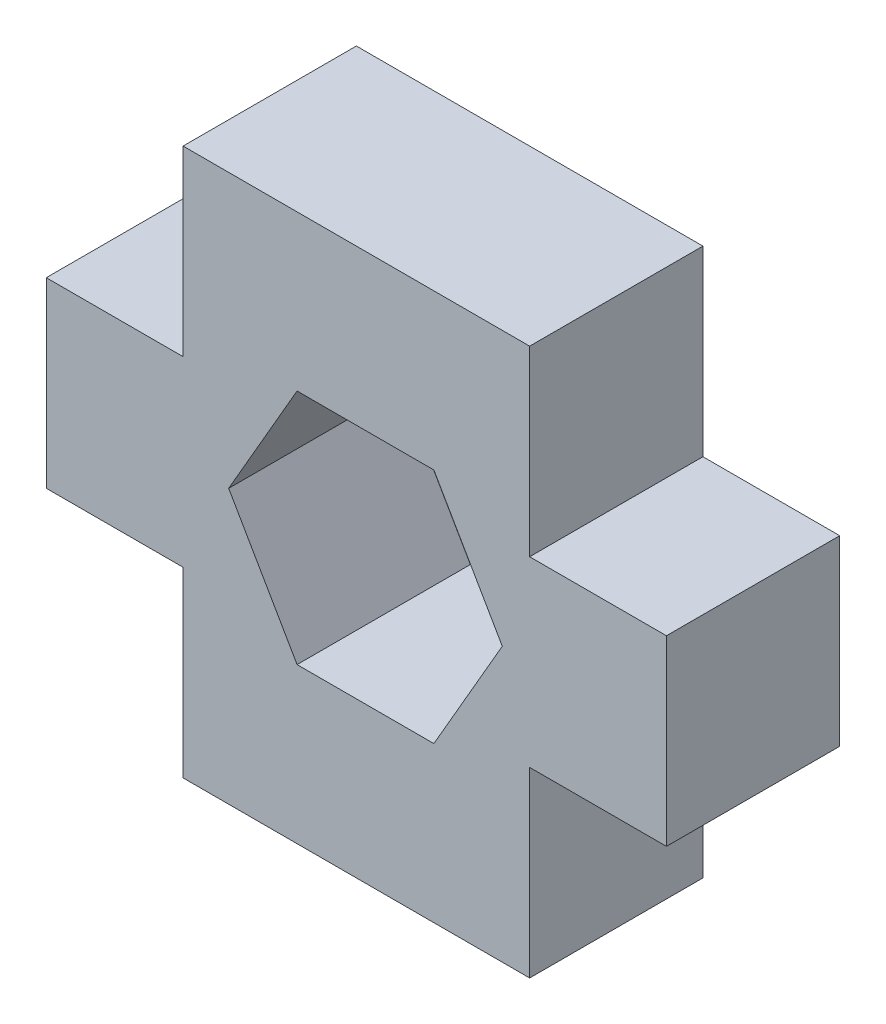
ISO-10303-21;
HEADER;
FILE_DESCRIPTION(('STEP AP214'),'2;1');
FILE_NAME('part.step','',(''),(''),'','','');
FILE_SCHEMA(('AUTOMOTIVE_DESIGN { 1 0 10303 214 1 1 1 1 }'));
ENDSEC;
DATA;
#1=APPLICATION_CONTEXT('core data for automotive mechanical design processes');
#2=APPLICATION_PROTOCOL_DEFINITION('international standard','automotive_design',2000,#1);
#3=PRODUCT_CONTEXT('',#1,'mechanical');
#4=PRODUCT('Part','Part','',(#3));
#5=PRODUCT_RELATED_PRODUCT_CATEGORY('part','',(#4));
#6=PRODUCT_DEFINITION_FORMATION('','',#4);
#7=PRODUCT_DEFINITION_CONTEXT('part definition',#1,'design');
#8=PRODUCT_DEFINITION('design','',#6,#7);
#9=PRODUCT_DEFINITION_SHAPE('','',#8);
#10=(LENGTH_UNIT() NAMED_UNIT(*) SI_UNIT(.MILLI.,.METRE.));
#11=(NAMED_UNIT(*) PLANE_ANGLE_UNIT() SI_UNIT($,.RADIAN.));
#12=(NAMED_UNIT(*) SI_UNIT($,.STERADIAN.) SOLID_ANGLE_UNIT());
#13=UNCERTAINTY_MEASURE_WITH_UNIT(LENGTH_MEASURE(1.E-05),#10,'distance_accuracy_value','');
#14=(GEOMETRIC_REPRESENTATION_CONTEXT(3) GLOBAL_UNCERTAINTY_ASSIGNED_CONTEXT((#13)) GLOBAL_UNIT_ASSIGNED_CONTEXT((#10,
#11,#12)) REPRESENTATION_CONTEXT('',''));
#15=CARTESIAN_POINT('',(0.,0.,0.));
#16=DIRECTION('',(0.,0.,1.));
#17=DIRECTION('',(1.,0.,0.));
#18=AXIS2_PLACEMENT_3D('',#15,#16,#17);
#19=CARTESIAN_POINT('',(0.,0.,3.8));
#20=DIRECTION('',(0.,0.,1.));
#21=DIRECTION('',(1.,0.,0.));
#22=AXIS2_PLACEMENT_3D('',#19,#20,#21);
#23=PLANE('',#22);
#24=DIRECTION('',(0.,-1.,0.));
#25=VECTOR('',#24,1.);
#26=CARTESIAN_POINT('',(0.,4.,3.8));
#27=LINE('',#26,#25);
#28=CARTESIAN_POINT('',(0.,4.,3.8));
#29=VERTEX_POINT('',#28);
#30=CARTESIAN_POINT('',(0.,0.,3.8));
#31=VERTEX_POINT('',#30);
#32=EDGE_CURVE('E209',#29,#31,#27,.T.);
#33=ORIENTED_EDGE('',*,*,#32,.T.);
#34=DIRECTION('',(1.,0.,0.));
#35=VECTOR('',#34,1.);
#36=CARTESIAN_POINT('',(0.,0.,3.8));
#37=LINE('',#36,#35);
#38=CARTESIAN_POINT('',(7.6,0.,3.8));
#39=VERTEX_POINT('',#38);
#40=EDGE_CURVE('E212',#31,#39,#37,.T.);
#41=ORIENTED_EDGE('',*,*,#40,.T.);
#42=DIRECTION('',(0.,1.,0.));
#43=VECTOR('',#42,1.);
#44=CARTESIAN_POINT('',(7.6,0.,3.8));
#45=LINE('',#44,#43);
#46=CARTESIAN_POINT('',(7.6,4.,3.8));
#47=VERTEX_POINT('',#46);
#48=EDGE_CURVE('E215',#39,#47,#45,.T.);
#49=ORIENTED_EDGE('',*,*,#48,.T.);
#50=DIRECTION('',(1.,0.,0.));
#51=VECTOR('',#50,1.);
#52=CARTESIAN_POINT('',(7.6,4.,3.8));
#53=LINE('',#52,#51);
#54=CARTESIAN_POINT('',(10.6,4.,3.8));
#55=VERTEX_POINT('',#54);
#56=EDGE_CURVE('E217',#47,#55,#53,.T.);
#57=ORIENTED_EDGE('',*,*,#56,.T.);
#58=DIRECTION('',(0.,1.,0.));
#59=VECTOR('',#58,1.);
#60=CARTESIAN_POINT('',(10.6,4.,3.8));
#61=LINE('',#60,#59);
#62=CARTESIAN_POINT('',(10.6,8.,3.8));
#63=VERTEX_POINT('',#62);
#64=EDGE_CURVE('E219',#55,#63,#61,.T.);
#65=ORIENTED_EDGE('',*,*,#64,.T.);
#66=DIRECTION('',(-1.,0.,0.));
#67=VECTOR('',#66,1.);
#68=CARTESIAN_POINT('',(7.6,8.,3.8));
#69=LINE('',#68,#67);
#70=CARTESIAN_POINT('',(7.6,8.,3.8));
#71=VERTEX_POINT('',#70);
#72=EDGE_CURVE('E221',#63,#71,#69,.T.);
#73=ORIENTED_EDGE('',*,*,#72,.T.);
#74=DIRECTION('',(0.,1.,0.));
#75=VECTOR('',#74,1.);
#76=CARTESIAN_POINT('',(7.6,8.,3.8));
#77=LINE('',#76,#75);
#78=CARTESIAN_POINT('',(7.6,12.,3.8));
#79=VERTEX_POINT('',#78);
#80=EDGE_CURVE('E223',#71,#79,#77,.T.);
#81=ORIENTED_EDGE('',*,*,#80,.T.);
#82=DIRECTION('',(-1.,0.,0.));
#83=VECTOR('',#82,1.);
#84=CARTESIAN_POINT('',(7.6,12.,3.8));
#85=LINE('',#84,#83);
#86=CARTESIAN_POINT('',(0.,12.,3.8));
#87=VERTEX_POINT('',#86);
#88=EDGE_CURVE('E225',#79,#87,#85,.T.);
#89=ORIENTED_EDGE('',*,*,#88,.T.);
#90=DIRECTION('',(0.,-1.,0.));
#91=VECTOR('',#90,1.);
#92=CARTESIAN_POINT('',(0.,12.,3.8));
#93=LINE('',#92,#91);
#94=CARTESIAN_POINT('',(0.,8.,3.8));
#95=VERTEX_POINT('',#94);
#96=EDGE_CURVE('E227',#87,#95,#93,.T.);
#97=ORIENTED_EDGE('',*,*,#96,.T.);
#98=DIRECTION('',(-1.,0.,0.));
#99=VECTOR('',#98,1.);
#100=CARTESIAN_POINT('',(0.,8.,3.8));
#101=LINE('',#100,#99);
#102=CARTESIAN_POINT('',(-3.,8.,3.8));
#103=VERTEX_POINT('',#102);
#104=EDGE_CURVE('E229',#95,#103,#101,.T.);
#105=ORIENTED_EDGE('',*,*,#104,.T.);
#106=DIRECTION('',(0.,-1.,0.));
#107=VECTOR('',#106,1.);
#108=CARTESIAN_POINT('',(-3.,8.,3.8));
#109=LINE('',#108,#107);
#110=CARTESIAN_POINT('',(-3.,4.,3.8));
#111=VERTEX_POINT('',#110);
#112=EDGE_CURVE('E231',#103,#111,#109,.T.);
#113=ORIENTED_EDGE('',*,*,#112,.T.);
#114=DIRECTION('',(1.,0.,0.));
#115=VECTOR('',#114,1.);
#116=CARTESIAN_POINT('',(-3.,4.,3.8));
#117=LINE('',#116,#115);
#118=EDGE_CURVE('E233',#111,#29,#117,.T.);
#119=ORIENTED_EDGE('',*,*,#118,.T.);
#120=EDGE_LOOP('',(#33,#41,#49,#57,#65,#73,#81,#89,#97,#105,#113,#119));
#121=FACE_BOUND('',#120,.T.);
#122=DIRECTION('',(-0.5,0.866025403784439,0.));
#123=VECTOR('',#122,1.);
#124=CARTESIAN_POINT('',(7.00000000000003,5.99999999999998,3.8));
#125=LINE('',#124,#123);
#126=CARTESIAN_POINT('',(7.00000000000003,5.99999999999998,3.8));
#127=VERTEX_POINT('',#126);
#128=CARTESIAN_POINT('',(5.50000000000002,8.59807621135331,3.8));
#129=VERTEX_POINT('',#128);
#130=EDGE_CURVE('E166',#127,#129,#125,.T.);
#131=ORIENTED_EDGE('',*,*,#130,.F.);
#132=DIRECTION('',(0.5,0.866025403784439,0.));
#133=VECTOR('',#132,1.);
#134=CARTESIAN_POINT('',(5.50000000000002,3.40192378864665,3.8));
#135=LINE('',#134,#133);
#136=CARTESIAN_POINT('',(5.50000000000002,3.40192378864665,3.8));
#137=VERTEX_POINT('',#136);
#138=EDGE_CURVE('E158',#137,#127,#135,.T.);
#139=ORIENTED_EDGE('',*,*,#138,.F.);
#140=DIRECTION('',(1.,0.,0.));
#141=VECTOR('',#140,1.);
#142=CARTESIAN_POINT('',(2.50000000000001,3.40192378864666,3.8));
#143=LINE('',#142,#141);
#144=CARTESIAN_POINT('',(2.50000000000001,3.40192378864666,3.8));
#145=VERTEX_POINT('',#144);
#146=EDGE_CURVE('E187',#145,#137,#143,.T.);
#147=ORIENTED_EDGE('',*,*,#146,.F.);
#148=DIRECTION('',(0.5,-0.866025403784438,0.));
#149=VECTOR('',#148,1.);
#150=CARTESIAN_POINT('',(1.,5.99999999999998,3.8));
#151=LINE('',#150,#149);
#152=CARTESIAN_POINT('',(1.,5.99999999999998,3.8));
#153=VERTEX_POINT('',#152);
#154=EDGE_CURVE('E185',#153,#145,#151,.T.);
#155=ORIENTED_EDGE('',*,*,#154,.F.);
#156=DIRECTION('',(-0.5,-0.866025403784439,0.));
#157=VECTOR('',#156,1.);
#158=CARTESIAN_POINT('',(2.50000000000001,8.59807621135331,3.8));
#159=LINE('',#158,#157);
#160=CARTESIAN_POINT('',(2.50000000000001,8.59807621135331,3.8));
#161=VERTEX_POINT('',#160);
#162=EDGE_CURVE('E181',#161,#153,#159,.T.);
#163=ORIENTED_EDGE('',*,*,#162,.F.);
#164=DIRECTION('',(-1.,0.,0.));
#165=VECTOR('',#164,1.);
#166=CARTESIAN_POINT('',(5.50000000000002,8.59807621135331,3.8));
#167=LINE('',#166,#165);
#168=EDGE_CURVE('E179',#129,#161,#167,.T.);
#169=ORIENTED_EDGE('',*,*,#168,.F.);
#170=EDGE_LOOP('',(#131,#139,#147,#155,#163,#169));
#171=FACE_BOUND('',#170,.T.);
#172=ADVANCED_FACE('F33',(#121,#171),#23,.T.);
#173=CARTESIAN_POINT('',(0.,0.,0.));
#174=DIRECTION('',(0.,0.,1.));
#175=DIRECTION('',(1.,0.,0.));
#176=AXIS2_PLACEMENT_3D('',#173,#174,#175);
#177=PLANE('',#176);
#178=DIRECTION('',(0.,-1.,0.));
#179=VECTOR('',#178,1.);
#180=CARTESIAN_POINT('',(0.,4.,0.));
#181=LINE('',#180,#179);
#182=CARTESIAN_POINT('',(0.,4.,0.));
#183=VERTEX_POINT('',#182);
#184=CARTESIAN_POINT('',(0.,0.,0.));
#185=VERTEX_POINT('',#184);
#186=EDGE_CURVE('E174',#183,#185,#181,.T.);
#187=ORIENTED_EDGE('',*,*,#186,.F.);
#188=DIRECTION('',(1.,0.,0.));
#189=VECTOR('',#188,1.);
#190=CARTESIAN_POINT('',(-3.,4.,0.));
#191=LINE('',#190,#189);
#192=CARTESIAN_POINT('',(-3.,4.,0.));
#193=VERTEX_POINT('',#192);
#194=EDGE_CURVE('E213',#193,#183,#191,.T.);
#195=ORIENTED_EDGE('',*,*,#194,.F.);
#196=DIRECTION('',(0.,-1.,0.));
#197=VECTOR('',#196,1.);
#198=CARTESIAN_POINT('',(-3.,8.,0.));
#199=LINE('',#198,#197);
#200=CARTESIAN_POINT('',(-3.,8.,0.));
#201=VERTEX_POINT('',#200);
#202=EDGE_CURVE('E256',#201,#193,#199,.T.);
#203=ORIENTED_EDGE('',*,*,#202,.F.);
#204=DIRECTION('',(-1.,0.,0.));
#205=VECTOR('',#204,1.);
#206=CARTESIAN_POINT('',(0.,8.,0.));
#207=LINE('',#206,#205);
#208=CARTESIAN_POINT('',(0.,8.,0.));
#209=VERTEX_POINT('',#208);
#210=EDGE_CURVE('E254',#209,#201,#207,.T.);
#211=ORIENTED_EDGE('',*,*,#210,.F.);
#212=DIRECTION('',(0.,-1.,0.));
#213=VECTOR('',#212,1.);
#214=CARTESIAN_POINT('',(0.,12.,0.));
#215=LINE('',#214,#213);
#216=CARTESIAN_POINT('',(0.,12.,0.));
#217=VERTEX_POINT('',#216);
#218=EDGE_CURVE('E252',#217,#209,#215,.T.);
#219=ORIENTED_EDGE('',*,*,#218,.F.);
#220=DIRECTION('',(-1.,0.,0.));
#221=VECTOR('',#220,1.);
#222=CARTESIAN_POINT('',(7.6,12.,0.));
#223=LINE('',#222,#221);
#224=CARTESIAN_POINT('',(7.6,12.,0.));
#225=VERTEX_POINT('',#224);
#226=EDGE_CURVE('E250',#225,#217,#223,.T.);
#227=ORIENTED_EDGE('',*,*,#226,.F.);
#228=DIRECTION('',(0.,1.,0.));
#229=VECTOR('',#228,1.);
#230=CARTESIAN_POINT('',(7.6,8.,0.));
#231=LINE('',#230,#229);
#232=CARTESIAN_POINT('',(7.6,8.,0.));
#233=VERTEX_POINT('',#232);
#234=EDGE_CURVE('E248',#233,#225,#231,.T.);
#235=ORIENTED_EDGE('',*,*,#234,.F.);
#236=DIRECTION('',(-1.,0.,0.));
#237=VECTOR('',#236,1.);
#238=CARTESIAN_POINT('',(7.6,8.,0.));
#239=LINE('',#238,#237);
#240=CARTESIAN_POINT('',(10.6,8.,0.));
#241=VERTEX_POINT('',#240);
#242=EDGE_CURVE('E246',#241,#233,#239,.T.);
#243=ORIENTED_EDGE('',*,*,#242,.F.);
#244=DIRECTION('',(0.,1.,0.));
#245=VECTOR('',#244,1.);
#246=CARTESIAN_POINT('',(10.6,4.,0.));
#247=LINE('',#246,#245);
#248=CARTESIAN_POINT('',(10.6,4.,0.));
#249=VERTEX_POINT('',#248);
#250=EDGE_CURVE('E244',#249,#241,#247,.T.);
#251=ORIENTED_EDGE('',*,*,#250,.F.);
#252=DIRECTION('',(1.,0.,0.));
#253=VECTOR('',#252,1.);
#254=CARTESIAN_POINT('',(7.6,4.,0.));
#255=LINE('',#254,#253);
#256=CARTESIAN_POINT('',(7.6,4.,0.));
#257=VERTEX_POINT('',#256);
#258=EDGE_CURVE('E242',#257,#249,#255,.T.);
#259=ORIENTED_EDGE('',*,*,#258,.F.);
#260=DIRECTION('',(0.,1.,0.));
#261=VECTOR('',#260,1.);
#262=CARTESIAN_POINT('',(7.6,0.,0.));
#263=LINE('',#262,#261);
#264=CARTESIAN_POINT('',(7.6,0.,0.));
#265=VERTEX_POINT('',#264);
#266=EDGE_CURVE('E240',#265,#257,#263,.T.);
#267=ORIENTED_EDGE('',*,*,#266,.F.);
#268=DIRECTION('',(1.,0.,0.));
#269=VECTOR('',#268,1.);
#270=CARTESIAN_POINT('',(0.,0.,0.));
#271=LINE('',#270,#269);
#272=EDGE_CURVE('E238',#185,#265,#271,.T.);
#273=ORIENTED_EDGE('',*,*,#272,.F.);
#274=EDGE_LOOP('',(#187,#195,#203,#211,#219,#227,#235,#243,#251,#259,#267,#273));
#275=FACE_BOUND('',#274,.T.);
#276=DIRECTION('',(0.5,0.866025403784439,0.));
#277=VECTOR('',#276,1.);
#278=CARTESIAN_POINT('',(5.50000000000002,3.40192378864665,0.));
#279=LINE('',#278,#277);
#280=CARTESIAN_POINT('',(5.50000000000002,3.40192378864665,0.));
#281=VERTEX_POINT('',#280);
#282=CARTESIAN_POINT('',(7.00000000000003,5.99999999999998,0.));
#283=VERTEX_POINT('',#282);
#284=EDGE_CURVE('E56',#281,#283,#279,.T.);
#285=ORIENTED_EDGE('',*,*,#284,.T.);
#286=DIRECTION('',(-0.5,0.866025403784439,0.));
#287=VECTOR('',#286,1.);
#288=CARTESIAN_POINT('',(7.00000000000003,5.99999999999998,0.));
#289=LINE('',#288,#287);
#290=CARTESIAN_POINT('',(5.50000000000002,8.59807621135331,0.));
#291=VERTEX_POINT('',#290);
#292=EDGE_CURVE('E173',#283,#291,#289,.T.);
#293=ORIENTED_EDGE('',*,*,#292,.T.);
#294=DIRECTION('',(-1.,0.,0.));
#295=VECTOR('',#294,1.);
#296=CARTESIAN_POINT('',(5.50000000000002,8.59807621135331,0.));
#297=LINE('',#296,#295);
#298=CARTESIAN_POINT('',(2.50000000000001,8.59807621135331,0.));
#299=VERTEX_POINT('',#298);
#300=EDGE_CURVE('E191',#291,#299,#297,.T.);
#301=ORIENTED_EDGE('',*,*,#300,.T.);
#302=DIRECTION('',(-0.5,-0.866025403784439,0.));
#303=VECTOR('',#302,1.);
#304=CARTESIAN_POINT('',(2.50000000000001,8.59807621135331,0.));
#305=LINE('',#304,#303);
#306=CARTESIAN_POINT('',(1.,5.99999999999998,0.));
#307=VERTEX_POINT('',#306);
#308=EDGE_CURVE('E194',#299,#307,#305,.T.);
#309=ORIENTED_EDGE('',*,*,#308,.T.);
#310=DIRECTION('',(0.5,-0.866025403784438,0.));
#311=VECTOR('',#310,1.);
#312=CARTESIAN_POINT('',(1.,5.99999999999998,0.));
#313=LINE('',#312,#311);
#314=CARTESIAN_POINT('',(2.50000000000001,3.40192378864666,0.));
#315=VERTEX_POINT('',#314);
#316=EDGE_CURVE('E197',#307,#315,#313,.T.);
#317=ORIENTED_EDGE('',*,*,#316,.T.);
#318=DIRECTION('',(1.,0.,0.));
#319=VECTOR('',#318,1.);
#320=CARTESIAN_POINT('',(2.50000000000001,3.40192378864666,0.));
#321=LINE('',#320,#319);
#322=EDGE_CURVE('E167',#315,#281,#321,.T.);
#323=ORIENTED_EDGE('',*,*,#322,.T.);
#324=EDGE_LOOP('',(#285,#293,#301,#309,#317,#323));
#325=FACE_BOUND('',#324,.T.);
#326=ADVANCED_FACE('F298',(#275,#325),#177,.F.);
#327=CARTESIAN_POINT('',(0.,4.,3.8));
#328=DIRECTION('',(1.,0.,0.));
#329=DIRECTION('',(0.,0.,-1.));
#330=AXIS2_PLACEMENT_3D('',#327,#328,#329);
#331=PLANE('',#330);
#332=ORIENTED_EDGE('',*,*,#186,.T.);
#333=DIRECTION('',(0.,0.,-1.));
#334=VECTOR('',#333,1.);
#335=CARTESIAN_POINT('',(0.,0.,3.8));
#336=LINE('',#335,#334);
#337=EDGE_CURVE('E11',#31,#185,#336,.T.);
#338=ORIENTED_EDGE('',*,*,#337,.F.);
#339=ORIENTED_EDGE('',*,*,#32,.F.);
#340=DIRECTION('',(0.,0.,-1.));
#341=VECTOR('',#340,1.);
#342=CARTESIAN_POINT('',(0.,4.,3.8));
#343=LINE('',#342,#341);
#344=EDGE_CURVE('E235',#29,#183,#343,.T.);
#345=ORIENTED_EDGE('',*,*,#344,.T.);
#346=EDGE_LOOP('',(#332,#338,#339,#345));
#347=FACE_BOUND('',#346,.T.);
#348=ADVANCED_FACE('F35',(#347),#331,.F.);
#349=CARTESIAN_POINT('',(0.,0.,3.8));
#350=DIRECTION('',(0.,1.,0.));
#351=DIRECTION('',(0.,0.,1.));
#352=AXIS2_PLACEMENT_3D('',#349,#350,#351);
#353=PLANE('',#352);
#354=ORIENTED_EDGE('',*,*,#272,.T.);
#355=DIRECTION('',(0.,0.,-1.));
#356=VECTOR('',#355,1.);
#357=CARTESIAN_POINT('',(7.6,0.,3.8));
#358=LINE('',#357,#356);
#359=EDGE_CURVE('E41',#39,#265,#358,.T.);
#360=ORIENTED_EDGE('',*,*,#359,.F.);
#361=ORIENTED_EDGE('',*,*,#40,.F.);
#362=ORIENTED_EDGE('',*,*,#337,.T.);
#363=EDGE_LOOP('',(#354,#360,#361,#362));
#364=FACE_BOUND('',#363,.T.);
#365=ADVANCED_FACE('F315',(#364),#353,.F.);
#366=CARTESIAN_POINT('',(7.6,0.,3.8));
#367=DIRECTION('',(-1.,0.,0.));
#368=DIRECTION('',(0.,0.,1.));
#369=AXIS2_PLACEMENT_3D('',#366,#367,#368);
#370=PLANE('',#369);
#371=ORIENTED_EDGE('',*,*,#266,.T.);
#372=DIRECTION('',(0.,0.,-1.));
#373=VECTOR('',#372,1.);
#374=CARTESIAN_POINT('',(7.6,4.,3.8));
#375=LINE('',#374,#373);
#376=EDGE_CURVE('E285',#47,#257,#375,.T.);
#377=ORIENTED_EDGE('',*,*,#376,.F.);
#378=ORIENTED_EDGE('',*,*,#48,.F.);
#379=ORIENTED_EDGE('',*,*,#359,.T.);
#380=EDGE_LOOP('',(#371,#377,#378,#379));
#381=FACE_BOUND('',#380,.T.);
#382=ADVANCED_FACE('F292',(#381),#370,.F.);
#383=CARTESIAN_POINT('',(7.6,4.,3.8));
#384=DIRECTION('',(0.,1.,0.));
#385=DIRECTION('',(-1.,0.,0.));
#386=AXIS2_PLACEMENT_3D('',#383,#384,#385);
#387=PLANE('',#386);
#388=ORIENTED_EDGE('',*,*,#258,.T.);
#389=DIRECTION('',(0.,0.,-1.));
#390=VECTOR('',#389,1.);
#391=CARTESIAN_POINT('',(10.6,4.,3.8));
#392=LINE('',#391,#390);
#393=EDGE_CURVE('E282',#55,#249,#392,.T.);
#394=ORIENTED_EDGE('',*,*,#393,.F.);
#395=ORIENTED_EDGE('',*,*,#56,.F.);
#396=ORIENTED_EDGE('',*,*,#376,.T.);
#397=EDGE_LOOP('',(#388,#394,#395,#396));
#398=FACE_BOUND('',#397,.T.);
#399=ADVANCED_FACE('F304',(#398),#387,.F.);
#400=CARTESIAN_POINT('',(10.6,4.,3.8));
#401=DIRECTION('',(-1.,0.,0.));
#402=DIRECTION('',(0.,0.,1.));
#403=AXIS2_PLACEMENT_3D('',#400,#401,#402);
#404=PLANE('',#403);
#405=ORIENTED_EDGE('',*,*,#250,.T.);
#406=DIRECTION('',(0.,0.,-1.));
#407=VECTOR('',#406,1.);
#408=CARTESIAN_POINT('',(10.6,8.,3.8));
#409=LINE('',#408,#407);
#410=EDGE_CURVE('E279',#63,#241,#409,.T.);
#411=ORIENTED_EDGE('',*,*,#410,.F.);
#412=ORIENTED_EDGE('',*,*,#64,.F.);
#413=ORIENTED_EDGE('',*,*,#393,.T.);
#414=EDGE_LOOP('',(#405,#411,#412,#413));
#415=FACE_BOUND('',#414,.T.);
#416=ADVANCED_FACE('F308',(#415),#404,.F.);
#417=CARTESIAN_POINT('',(7.6,8.,3.8));
#418=DIRECTION('',(0.,-1.,0.));
#419=DIRECTION('',(0.,0.,-1.));
#420=AXIS2_PLACEMENT_3D('',#417,#418,#419);
#421=PLANE('',#420);
#422=ORIENTED_EDGE('',*,*,#242,.T.);
#423=DIRECTION('',(0.,0.,-1.));
#424=VECTOR('',#423,1.);
#425=CARTESIAN_POINT('',(7.6,8.,3.8));
#426=LINE('',#425,#424);
#427=EDGE_CURVE('E276',#71,#233,#426,.T.);
#428=ORIENTED_EDGE('',*,*,#427,.F.);
#429=ORIENTED_EDGE('',*,*,#72,.F.);
#430=ORIENTED_EDGE('',*,*,#410,.T.);
#431=EDGE_LOOP('',(#422,#428,#429,#430));
#432=FACE_BOUND('',#431,.T.);
#433=ADVANCED_FACE('F348',(#432),#421,.F.);
#434=CARTESIAN_POINT('',(7.6,8.,3.8));
#435=DIRECTION('',(-1.,0.,0.));
#436=DIRECTION('',(0.,0.,1.));
#437=AXIS2_PLACEMENT_3D('',#434,#435,#436);
#438=PLANE('',#437);
#439=ORIENTED_EDGE('',*,*,#234,.T.);
#440=DIRECTION('',(0.,0.,-1.));
#441=VECTOR('',#440,1.);
#442=CARTESIAN_POINT('',(7.6,12.,3.8));
#443=LINE('',#442,#441);
#444=EDGE_CURVE('E273',#79,#225,#443,.T.);
#445=ORIENTED_EDGE('',*,*,#444,.F.);
#446=ORIENTED_EDGE('',*,*,#80,.F.);
#447=ORIENTED_EDGE('',*,*,#427,.T.);
#448=EDGE_LOOP('',(#439,#445,#446,#447));
#449=FACE_BOUND('',#448,.T.);
#450=ADVANCED_FACE('F346',(#449),#438,.F.);
#451=CARTESIAN_POINT('',(7.6,12.,3.8));
#452=DIRECTION('',(0.,-1.,0.));
#453=DIRECTION('',(1.,0.,0.));
#454=AXIS2_PLACEMENT_3D('',#451,#452,#453);
#455=PLANE('',#454);
#456=ORIENTED_EDGE('',*,*,#226,.T.);
#457=DIRECTION('',(0.,0.,-1.));
#458=VECTOR('',#457,1.);
#459=CARTESIAN_POINT('',(0.,12.,3.8));
#460=LINE('',#459,#458);
#461=EDGE_CURVE('E270',#87,#217,#460,.T.);
#462=ORIENTED_EDGE('',*,*,#461,.F.);
#463=ORIENTED_EDGE('',*,*,#88,.F.);
#464=ORIENTED_EDGE('',*,*,#444,.T.);
#465=EDGE_LOOP('',(#456,#462,#463,#464));
#466=FACE_BOUND('',#465,.T.);
#467=ADVANCED_FACE('F342',(#466),#455,.F.);
#468=CARTESIAN_POINT('',(0.,12.,3.8));
#469=DIRECTION('',(1.,0.,0.));
#470=DIRECTION('',(0.,0.,-1.));
#471=AXIS2_PLACEMENT_3D('',#468,#469,#470);
#472=PLANE('',#471);
#473=ORIENTED_EDGE('',*,*,#218,.T.);
#474=DIRECTION('',(0.,0.,-1.));
#475=VECTOR('',#474,1.);
#476=CARTESIAN_POINT('',(0.,8.,3.8));
#477=LINE('',#476,#475);
#478=EDGE_CURVE('E267',#95,#209,#477,.T.);
#479=ORIENTED_EDGE('',*,*,#478,.F.);
#480=ORIENTED_EDGE('',*,*,#96,.F.);
#481=ORIENTED_EDGE('',*,*,#461,.T.);
#482=EDGE_LOOP('',(#473,#479,#480,#481));
#483=FACE_BOUND('',#482,.T.);
#484=ADVANCED_FACE('F337',(#483),#472,.F.);
#485=CARTESIAN_POINT('',(0.,8.,3.8));
#486=DIRECTION('',(0.,-1.,0.));
#487=DIRECTION('',(0.,0.,-1.));
#488=AXIS2_PLACEMENT_3D('',#485,#486,#487);
#489=PLANE('',#488);
#490=ORIENTED_EDGE('',*,*,#210,.T.);
#491=DIRECTION('',(0.,0.,-1.));
#492=VECTOR('',#491,1.);
#493=CARTESIAN_POINT('',(-3.,8.,3.8));
#494=LINE('',#493,#492);
#495=EDGE_CURVE('E264',#103,#201,#494,.T.);
#496=ORIENTED_EDGE('',*,*,#495,.F.);
#497=ORIENTED_EDGE('',*,*,#104,.F.);
#498=ORIENTED_EDGE('',*,*,#478,.T.);
#499=EDGE_LOOP('',(#490,#496,#497,#498));
#500=FACE_BOUND('',#499,.T.);
#501=ADVANCED_FACE('F331',(#500),#489,.F.);
#502=CARTESIAN_POINT('',(-3.,8.,3.8));
#503=DIRECTION('',(1.,0.,0.));
#504=DIRECTION('',(0.,0.,-1.));
#505=AXIS2_PLACEMENT_3D('',#502,#503,#504);
#506=PLANE('',#505);
#507=ORIENTED_EDGE('',*,*,#202,.T.);
#508=DIRECTION('',(0.,0.,-1.));
#509=VECTOR('',#508,1.);
#510=CARTESIAN_POINT('',(-3.,4.,3.8));
#511=LINE('',#510,#509);
#512=EDGE_CURVE('E261',#111,#193,#511,.T.);
#513=ORIENTED_EDGE('',*,*,#512,.F.);
#514=ORIENTED_EDGE('',*,*,#112,.F.);
#515=ORIENTED_EDGE('',*,*,#495,.T.);
#516=EDGE_LOOP('',(#507,#513,#514,#515));
#517=FACE_BOUND('',#516,.T.);
#518=ADVANCED_FACE('F327',(#517),#506,.F.);
#519=CARTESIAN_POINT('',(-3.,4.,3.8));
#520=DIRECTION('',(0.,1.,0.));
#521=DIRECTION('',(0.,0.,1.));
#522=AXIS2_PLACEMENT_3D('',#519,#520,#521);
#523=PLANE('',#522);
#524=ORIENTED_EDGE('',*,*,#194,.T.);
#525=ORIENTED_EDGE('',*,*,#344,.F.);
#526=ORIENTED_EDGE('',*,*,#118,.F.);
#527=ORIENTED_EDGE('',*,*,#512,.T.);
#528=EDGE_LOOP('',(#524,#525,#526,#527));
#529=FACE_BOUND('',#528,.T.);
#530=ADVANCED_FACE('F322',(#529),#523,.F.);
#531=CARTESIAN_POINT('',(5.50000000000002,3.40192378864665,3.8));
#532=DIRECTION('',(-0.866025403784438,0.5,0.));
#533=DIRECTION('',(-0.5,-0.866025403784439,0.));
#534=AXIS2_PLACEMENT_3D('',#531,#532,#533);
#535=PLANE('',#534);
#536=ORIENTED_EDGE('',*,*,#284,.F.);
#537=DIRECTION('',(0.,0.,-1.));
#538=VECTOR('',#537,1.);
#539=CARTESIAN_POINT('',(5.50000000000002,3.40192378864665,3.8));
#540=LINE('',#539,#538);
#541=EDGE_CURVE('E162',#137,#281,#540,.T.);
#542=ORIENTED_EDGE('',*,*,#541,.F.);
#543=ORIENTED_EDGE('',*,*,#138,.T.);
#544=DIRECTION('',(0.,0.,-1.));
#545=VECTOR('',#544,1.);
#546=CARTESIAN_POINT('',(7.00000000000003,5.99999999999998,3.8));
#547=LINE('',#546,#545);
#548=EDGE_CURVE('E161',#127,#283,#547,.T.);
#549=ORIENTED_EDGE('',*,*,#548,.T.);
#550=EDGE_LOOP('',(#536,#542,#543,#549));
#551=FACE_BOUND('',#550,.T.);
#552=ADVANCED_FACE('F160',(#551),#535,.T.);
#553=CARTESIAN_POINT('',(7.00000000000003,5.99999999999998,3.8));
#554=DIRECTION('',(-0.866025403784439,-0.5,0.));
#555=DIRECTION('',(0.5,-0.866025403784439,0.));
#556=AXIS2_PLACEMENT_3D('',#553,#554,#555);
#557=PLANE('',#556);
#558=ORIENTED_EDGE('',*,*,#292,.F.);
#559=ORIENTED_EDGE('',*,*,#548,.F.);
#560=ORIENTED_EDGE('',*,*,#130,.T.);
#561=DIRECTION('',(0.,0.,-1.));
#562=VECTOR('',#561,1.);
#563=CARTESIAN_POINT('',(5.50000000000002,8.59807621135331,3.8));
#564=LINE('',#563,#562);
#565=EDGE_CURVE('E175',#129,#291,#564,.T.);
#566=ORIENTED_EDGE('',*,*,#565,.T.);
#567=EDGE_LOOP('',(#558,#559,#560,#566));
#568=FACE_BOUND('',#567,.T.);
#569=ADVANCED_FACE('F170',(#568),#557,.T.);
#570=CARTESIAN_POINT('',(5.50000000000002,8.59807621135331,3.8));
#571=DIRECTION('',(0.,-1.,0.));
#572=DIRECTION('',(1.,0.,0.));
#573=AXIS2_PLACEMENT_3D('',#570,#571,#572);
#574=PLANE('',#573);
#575=ORIENTED_EDGE('',*,*,#300,.F.);
#576=ORIENTED_EDGE('',*,*,#565,.F.);
#577=ORIENTED_EDGE('',*,*,#168,.T.);
#578=DIRECTION('',(0.,0.,-1.));
#579=VECTOR('',#578,1.);
#580=CARTESIAN_POINT('',(2.50000000000001,8.59807621135331,3.8));
#581=LINE('',#580,#579);
#582=EDGE_CURVE('E206',#161,#299,#581,.T.);
#583=ORIENTED_EDGE('',*,*,#582,.T.);
#584=EDGE_LOOP('',(#575,#576,#577,#583));
#585=FACE_BOUND('',#584,.T.);
#586=ADVANCED_FACE('F406',(#585),#574,.T.);
#587=CARTESIAN_POINT('',(2.50000000000001,8.59807621135331,3.8));
#588=DIRECTION('',(0.866025403784438,-0.5,0.));
#589=DIRECTION('',(0.5,0.866025403784439,0.));
#590=AXIS2_PLACEMENT_3D('',#587,#588,#589);
#591=PLANE('',#590);
#592=ORIENTED_EDGE('',*,*,#308,.F.);
#593=ORIENTED_EDGE('',*,*,#582,.F.);
#594=ORIENTED_EDGE('',*,*,#162,.T.);
#595=DIRECTION('',(0.,0.,-1.));
#596=VECTOR('',#595,1.);
#597=CARTESIAN_POINT('',(1.,5.99999999999998,3.8));
#598=LINE('',#597,#596);
#599=EDGE_CURVE('E204',#153,#307,#598,.T.);
#600=ORIENTED_EDGE('',*,*,#599,.T.);
#601=EDGE_LOOP('',(#592,#593,#594,#600));
#602=FACE_BOUND('',#601,.T.);
#603=ADVANCED_FACE('F412',(#602),#591,.T.);
#604=CARTESIAN_POINT('',(1.,5.99999999999998,3.8));
#605=DIRECTION('',(0.866025403784439,0.5,0.));
#606=DIRECTION('',(-0.5,0.866025403784439,0.));
#607=AXIS2_PLACEMENT_3D('',#604,#605,#606);
#608=PLANE('',#607);
#609=ORIENTED_EDGE('',*,*,#316,.F.);
#610=ORIENTED_EDGE('',*,*,#599,.F.);
#611=ORIENTED_EDGE('',*,*,#154,.T.);
#612=DIRECTION('',(0.,0.,-1.));
#613=VECTOR('',#612,1.);
#614=CARTESIAN_POINT('',(2.50000000000001,3.40192378864666,3.8));
#615=LINE('',#614,#613);
#616=EDGE_CURVE('E48',#145,#315,#615,.T.);
#617=ORIENTED_EDGE('',*,*,#616,.T.);
#618=EDGE_LOOP('',(#609,#610,#611,#617));
#619=FACE_BOUND('',#618,.T.);
#620=ADVANCED_FACE('F420',(#619),#608,.T.);
#621=CARTESIAN_POINT('',(2.50000000000001,3.40192378864666,3.8));
#622=DIRECTION('',(0.,1.,0.));
#623=DIRECTION('',(-1.,0.,0.));
#624=AXIS2_PLACEMENT_3D('',#621,#622,#623);
#625=PLANE('',#624);
#626=ORIENTED_EDGE('',*,*,#322,.F.);
#627=ORIENTED_EDGE('',*,*,#616,.F.);
#628=ORIENTED_EDGE('',*,*,#146,.T.);
#629=ORIENTED_EDGE('',*,*,#541,.T.);
#630=EDGE_LOOP('',(#626,#627,#628,#629));
#631=FACE_BOUND('',#630,.T.);
#632=ADVANCED_FACE('F428',(#631),#625,.T.);
#633=CLOSED_SHELL('',(#172,#326,#348,#365,#382,#399,#416,#433,#450,#467,#484,#501,#518,#530,
#552,#569,#586,#603,#620,#632));
#634=MANIFOLD_SOLID_BREP('B2',#633);
#635=ADVANCED_BREP_SHAPE_REPRESENTATION('',(#18,#634),#14);
#636=SHAPE_DEFINITION_REPRESENTATION(#9,#635);
ENDSEC;
END-ISO-10303-21;
